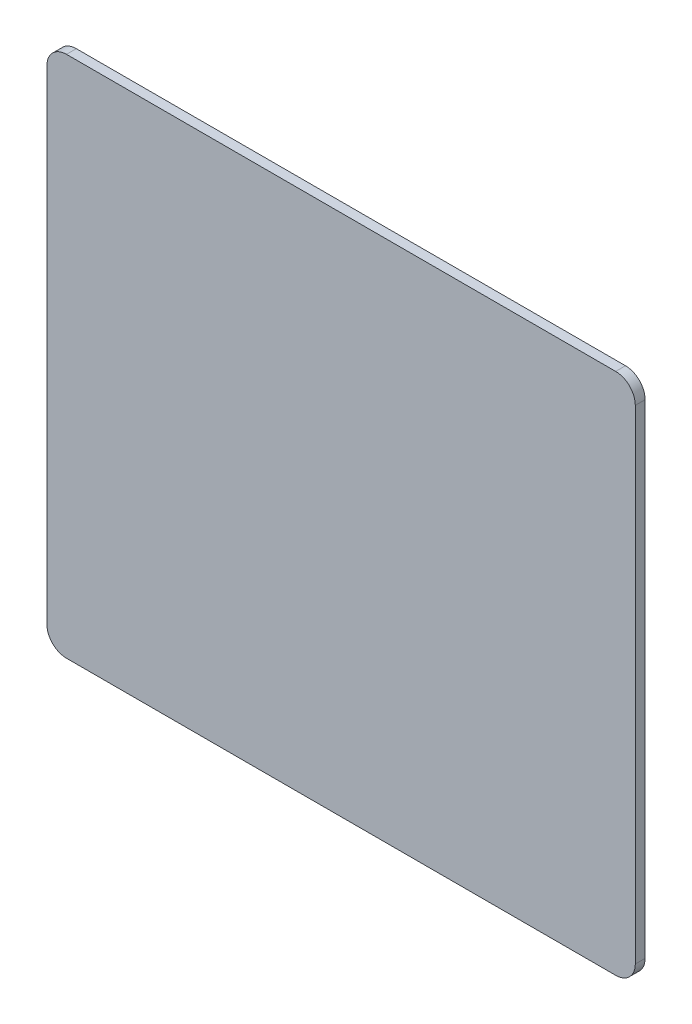
ISO-10303-21;
HEADER;
FILE_DESCRIPTION(('STEP AP214'),'2;1');
FILE_NAME('part.step','',(''),(''),'','','');
FILE_SCHEMA(('AUTOMOTIVE_DESIGN { 1 0 10303 214 1 1 1 1 }'));
ENDSEC;
DATA;
#1=APPLICATION_CONTEXT('core data for automotive mechanical design processes');
#2=APPLICATION_PROTOCOL_DEFINITION('international standard','automotive_design',2000,#1);
#3=PRODUCT_CONTEXT('',#1,'mechanical');
#4=PRODUCT('Part','Part','',(#3));
#5=PRODUCT_RELATED_PRODUCT_CATEGORY('part','',(#4));
#6=PRODUCT_DEFINITION_FORMATION('','',#4);
#7=PRODUCT_DEFINITION_CONTEXT('part definition',#1,'design');
#8=PRODUCT_DEFINITION('design','',#6,#7);
#9=PRODUCT_DEFINITION_SHAPE('','',#8);
#10=(LENGTH_UNIT() NAMED_UNIT(*) SI_UNIT(.MILLI.,.METRE.));
#11=(NAMED_UNIT(*) PLANE_ANGLE_UNIT() SI_UNIT($,.RADIAN.));
#12=(NAMED_UNIT(*) SI_UNIT($,.STERADIAN.) SOLID_ANGLE_UNIT());
#13=UNCERTAINTY_MEASURE_WITH_UNIT(LENGTH_MEASURE(1.E-05),#10,'distance_accuracy_value','');
#14=(GEOMETRIC_REPRESENTATION_CONTEXT(3) GLOBAL_UNCERTAINTY_ASSIGNED_CONTEXT((#13)) GLOBAL_UNIT_ASSIGNED_CONTEXT((#10,
#11,#12)) REPRESENTATION_CONTEXT('',''));
#15=CARTESIAN_POINT('',(0.,0.,0.));
#16=DIRECTION('',(0.,0.,1.));
#17=DIRECTION('',(1.,0.,0.));
#18=AXIS2_PLACEMENT_3D('',#15,#16,#17);
#19=CARTESIAN_POINT('',(42.,37.,1.5));
#20=DIRECTION('',(0.,0.,-1.));
#21=DIRECTION('',(-1.,0.,0.));
#22=AXIS2_PLACEMENT_3D('',#19,#20,#21);
#23=CYLINDRICAL_SURFACE('',#22,3.);
#24=CARTESIAN_POINT('',(42.,37.,0.));
#25=DIRECTION('',(0.,0.,1.));
#26=DIRECTION('',(-1.,0.,0.));
#27=AXIS2_PLACEMENT_3D('',#24,#25,#26);
#28=CIRCLE('',#27,3.);
#29=CARTESIAN_POINT('',(45.,37.,0.));
#30=VERTEX_POINT('',#29);
#31=CARTESIAN_POINT('',(42.,40.,0.));
#32=VERTEX_POINT('',#31);
#33=EDGE_CURVE('E129',#30,#32,#28,.T.);
#34=ORIENTED_EDGE('',*,*,#33,.T.);
#35=DIRECTION('',(0.,0.,-1.));
#36=VECTOR('',#35,1.);
#37=CARTESIAN_POINT('',(42.,40.,1.5));
#38=LINE('',#37,#36);
#39=CARTESIAN_POINT('',(42.,40.,1.5));
#40=VERTEX_POINT('',#39);
#41=EDGE_CURVE('E11',#40,#32,#38,.T.);
#42=ORIENTED_EDGE('',*,*,#41,.F.);
#43=CARTESIAN_POINT('',(42.,37.,1.5));
#44=DIRECTION('',(0.,0.,1.));
#45=DIRECTION('',(-1.,0.,0.));
#46=AXIS2_PLACEMENT_3D('',#43,#44,#45);
#47=CIRCLE('',#46,3.);
#48=CARTESIAN_POINT('',(45.,37.,1.5));
#49=VERTEX_POINT('',#48);
#50=EDGE_CURVE('E143',#49,#40,#47,.T.);
#51=ORIENTED_EDGE('',*,*,#50,.F.);
#52=DIRECTION('',(0.,0.,-1.));
#53=VECTOR('',#52,1.);
#54=CARTESIAN_POINT('',(45.,37.,1.5));
#55=LINE('',#54,#53);
#56=EDGE_CURVE('E125',#49,#30,#55,.T.);
#57=ORIENTED_EDGE('',*,*,#56,.T.);
#58=EDGE_LOOP('',(#34,#42,#51,#57));
#59=FACE_BOUND('',#58,.T.);
#60=ADVANCED_FACE('F33',(#59),#23,.T.);
#61=CARTESIAN_POINT('',(42.,40.,1.5));
#62=DIRECTION('',(0.,-1.,0.));
#63=DIRECTION('',(1.,0.,0.));
#64=AXIS2_PLACEMENT_3D('',#61,#62,#63);
#65=PLANE('',#64);
#66=DIRECTION('',(-1.,0.,0.));
#67=VECTOR('',#66,1.);
#68=CARTESIAN_POINT('',(42.,40.,0.));
#69=LINE('',#68,#67);
#70=CARTESIAN_POINT('',(-42.,40.,0.));
#71=VERTEX_POINT('',#70);
#72=EDGE_CURVE('E132',#32,#71,#69,.T.);
#73=ORIENTED_EDGE('',*,*,#72,.T.);
#74=DIRECTION('',(0.,0.,-1.));
#75=VECTOR('',#74,1.);
#76=CARTESIAN_POINT('',(-42.,40.,1.5));
#77=LINE('',#76,#75);
#78=CARTESIAN_POINT('',(-42.,40.,1.5));
#79=VERTEX_POINT('',#78);
#80=EDGE_CURVE('E41',#79,#71,#77,.T.);
#81=ORIENTED_EDGE('',*,*,#80,.F.);
#82=DIRECTION('',(-1.,0.,0.));
#83=VECTOR('',#82,1.);
#84=CARTESIAN_POINT('',(42.,40.,1.5));
#85=LINE('',#84,#83);
#86=EDGE_CURVE('E92',#40,#79,#85,.T.);
#87=ORIENTED_EDGE('',*,*,#86,.F.);
#88=ORIENTED_EDGE('',*,*,#41,.T.);
#89=EDGE_LOOP('',(#73,#81,#87,#88));
#90=FACE_BOUND('',#89,.T.);
#91=ADVANCED_FACE('F178',(#90),#65,.F.);
#92=CARTESIAN_POINT('',(-42.,37.,1.5));
#93=DIRECTION('',(0.,0.,-1.));
#94=DIRECTION('',(-1.,0.,0.));
#95=AXIS2_PLACEMENT_3D('',#92,#93,#94);
#96=CYLINDRICAL_SURFACE('',#95,3.);
#97=CARTESIAN_POINT('',(-42.,37.,0.));
#98=DIRECTION('',(0.,0.,1.));
#99=DIRECTION('',(-1.,0.,0.));
#100=AXIS2_PLACEMENT_3D('',#97,#98,#99);
#101=CIRCLE('',#100,3.);
#102=CARTESIAN_POINT('',(-45.,37.,0.));
#103=VERTEX_POINT('',#102);
#104=EDGE_CURVE('E134',#71,#103,#101,.T.);
#105=ORIENTED_EDGE('',*,*,#104,.T.);
#106=DIRECTION('',(0.,0.,-1.));
#107=VECTOR('',#106,1.);
#108=CARTESIAN_POINT('',(-45.,37.,1.5));
#109=LINE('',#108,#107);
#110=CARTESIAN_POINT('',(-45.,37.,1.5));
#111=VERTEX_POINT('',#110);
#112=EDGE_CURVE('E150',#111,#103,#109,.T.);
#113=ORIENTED_EDGE('',*,*,#112,.F.);
#114=CARTESIAN_POINT('',(-42.,37.,1.5));
#115=DIRECTION('',(0.,0.,1.));
#116=DIRECTION('',(-1.,0.,0.));
#117=AXIS2_PLACEMENT_3D('',#114,#115,#116);
#118=CIRCLE('',#117,3.);
#119=EDGE_CURVE('E158',#79,#111,#118,.T.);
#120=ORIENTED_EDGE('',*,*,#119,.F.);
#121=ORIENTED_EDGE('',*,*,#80,.T.);
#122=EDGE_LOOP('',(#105,#113,#120,#121));
#123=FACE_BOUND('',#122,.T.);
#124=ADVANCED_FACE('F156',(#123),#96,.T.);
#125=CARTESIAN_POINT('',(-45.,-37.,1.5));
#126=DIRECTION('',(1.,0.,0.));
#127=DIRECTION('',(0.,0.,-1.));
#128=AXIS2_PLACEMENT_3D('',#125,#126,#127);
#129=PLANE('',#128);
#130=DIRECTION('',(0.,-1.,0.));
#131=VECTOR('',#130,1.);
#132=CARTESIAN_POINT('',(-45.,-37.,0.));
#133=LINE('',#132,#131);
#134=CARTESIAN_POINT('',(-45.,-37.,0.));
#135=VERTEX_POINT('',#134);
#136=EDGE_CURVE('E136',#103,#135,#133,.T.);
#137=ORIENTED_EDGE('',*,*,#136,.T.);
#138=DIRECTION('',(0.,0.,-1.));
#139=VECTOR('',#138,1.);
#140=CARTESIAN_POINT('',(-45.,-37.,1.5));
#141=LINE('',#140,#139);
#142=CARTESIAN_POINT('',(-45.,-37.,1.5));
#143=VERTEX_POINT('',#142);
#144=EDGE_CURVE('E147',#143,#135,#141,.T.);
#145=ORIENTED_EDGE('',*,*,#144,.F.);
#146=DIRECTION('',(0.,-1.,0.));
#147=VECTOR('',#146,1.);
#148=CARTESIAN_POINT('',(-45.,-37.,1.5));
#149=LINE('',#148,#147);
#150=EDGE_CURVE('E170',#111,#143,#149,.T.);
#151=ORIENTED_EDGE('',*,*,#150,.F.);
#152=ORIENTED_EDGE('',*,*,#112,.T.);
#153=EDGE_LOOP('',(#137,#145,#151,#152));
#154=FACE_BOUND('',#153,.T.);
#155=ADVANCED_FACE('F166',(#154),#129,.F.);
#156=CARTESIAN_POINT('',(-42.,-37.,1.5));
#157=DIRECTION('',(0.,0.,-1.));
#158=DIRECTION('',(-1.,0.,0.));
#159=AXIS2_PLACEMENT_3D('',#156,#157,#158);
#160=CYLINDRICAL_SURFACE('',#159,3.);
#161=CARTESIAN_POINT('',(-42.,-37.,0.));
#162=DIRECTION('',(0.,0.,1.));
#163=DIRECTION('',(1.,0.,0.));
#164=AXIS2_PLACEMENT_3D('',#161,#162,#163);
#165=CIRCLE('',#164,3.);
#166=CARTESIAN_POINT('',(-42.,-40.,0.));
#167=VERTEX_POINT('',#166);
#168=EDGE_CURVE('E138',#135,#167,#165,.T.);
#169=ORIENTED_EDGE('',*,*,#168,.T.);
#170=DIRECTION('',(0.,0.,-1.));
#171=VECTOR('',#170,1.);
#172=CARTESIAN_POINT('',(-42.,-40.,1.5));
#173=LINE('',#172,#171);
#174=CARTESIAN_POINT('',(-42.,-40.,1.5));
#175=VERTEX_POINT('',#174);
#176=EDGE_CURVE('E120',#175,#167,#173,.T.);
#177=ORIENTED_EDGE('',*,*,#176,.F.);
#178=CARTESIAN_POINT('',(-42.,-37.,1.5));
#179=DIRECTION('',(0.,0.,1.));
#180=DIRECTION('',(1.,0.,0.));
#181=AXIS2_PLACEMENT_3D('',#178,#179,#180);
#182=CIRCLE('',#181,3.);
#183=EDGE_CURVE('E111',#143,#175,#182,.T.);
#184=ORIENTED_EDGE('',*,*,#183,.F.);
#185=ORIENTED_EDGE('',*,*,#144,.T.);
#186=EDGE_LOOP('',(#169,#177,#184,#185));
#187=FACE_BOUND('',#186,.T.);
#188=ADVANCED_FACE('F169',(#187),#160,.T.);
#189=CARTESIAN_POINT('',(42.,-40.,1.5));
#190=DIRECTION('',(0.,1.,0.));
#191=DIRECTION('',(-1.,0.,0.));
#192=AXIS2_PLACEMENT_3D('',#189,#190,#191);
#193=PLANE('',#192);
#194=DIRECTION('',(1.,0.,0.));
#195=VECTOR('',#194,1.);
#196=CARTESIAN_POINT('',(42.,-40.,0.));
#197=LINE('',#196,#195);
#198=CARTESIAN_POINT('',(42.,-40.,0.));
#199=VERTEX_POINT('',#198);
#200=EDGE_CURVE('E119',#167,#199,#197,.T.);
#201=ORIENTED_EDGE('',*,*,#200,.T.);
#202=DIRECTION('',(0.,0.,-1.));
#203=VECTOR('',#202,1.);
#204=CARTESIAN_POINT('',(42.,-40.,1.5));
#205=LINE('',#204,#203);
#206=CARTESIAN_POINT('',(42.,-40.,1.5));
#207=VERTEX_POINT('',#206);
#208=EDGE_CURVE('E116',#207,#199,#205,.T.);
#209=ORIENTED_EDGE('',*,*,#208,.F.);
#210=DIRECTION('',(1.,0.,0.));
#211=VECTOR('',#210,1.);
#212=CARTESIAN_POINT('',(42.,-40.,1.5));
#213=LINE('',#212,#211);
#214=EDGE_CURVE('E105',#175,#207,#213,.T.);
#215=ORIENTED_EDGE('',*,*,#214,.F.);
#216=ORIENTED_EDGE('',*,*,#176,.T.);
#217=EDGE_LOOP('',(#201,#209,#215,#216));
#218=FACE_BOUND('',#217,.T.);
#219=ADVANCED_FACE('F117',(#218),#193,.F.);
#220=CARTESIAN_POINT('',(42.,-37.,1.5));
#221=DIRECTION('',(0.,0.,-1.));
#222=DIRECTION('',(-1.,0.,0.));
#223=AXIS2_PLACEMENT_3D('',#220,#221,#222);
#224=CYLINDRICAL_SURFACE('',#223,3.);
#225=CARTESIAN_POINT('',(42.,-37.,0.));
#226=DIRECTION('',(0.,0.,1.));
#227=DIRECTION('',(-1.,0.,0.));
#228=AXIS2_PLACEMENT_3D('',#225,#226,#227);
#229=CIRCLE('',#228,3.);
#230=CARTESIAN_POINT('',(45.,-37.,0.));
#231=VERTEX_POINT('',#230);
#232=EDGE_CURVE('E78',#199,#231,#229,.T.);
#233=ORIENTED_EDGE('',*,*,#232,.T.);
#234=DIRECTION('',(0.,0.,-1.));
#235=VECTOR('',#234,1.);
#236=CARTESIAN_POINT('',(45.,-37.,1.5));
#237=LINE('',#236,#235);
#238=CARTESIAN_POINT('',(45.,-37.,1.5));
#239=VERTEX_POINT('',#238);
#240=EDGE_CURVE('E121',#239,#231,#237,.T.);
#241=ORIENTED_EDGE('',*,*,#240,.F.);
#242=CARTESIAN_POINT('',(42.,-37.,1.5));
#243=DIRECTION('',(0.,0.,1.));
#244=DIRECTION('',(-1.,0.,0.));
#245=AXIS2_PLACEMENT_3D('',#242,#243,#244);
#246=CIRCLE('',#245,3.);
#247=EDGE_CURVE('E109',#207,#239,#246,.T.);
#248=ORIENTED_EDGE('',*,*,#247,.F.);
#249=ORIENTED_EDGE('',*,*,#208,.T.);
#250=EDGE_LOOP('',(#233,#241,#248,#249));
#251=FACE_BOUND('',#250,.T.);
#252=ADVANCED_FACE('F123',(#251),#224,.T.);
#253=CARTESIAN_POINT('',(45.,-37.,1.5));
#254=DIRECTION('',(-1.,0.,0.));
#255=DIRECTION('',(0.,0.,1.));
#256=AXIS2_PLACEMENT_3D('',#253,#254,#255);
#257=PLANE('',#256);
#258=DIRECTION('',(0.,1.,0.));
#259=VECTOR('',#258,1.);
#260=CARTESIAN_POINT('',(45.,-37.,0.));
#261=LINE('',#260,#259);
#262=EDGE_CURVE('E84',#231,#30,#261,.T.);
#263=ORIENTED_EDGE('',*,*,#262,.T.);
#264=ORIENTED_EDGE('',*,*,#56,.F.);
#265=DIRECTION('',(0.,1.,0.));
#266=VECTOR('',#265,1.);
#267=CARTESIAN_POINT('',(45.,-37.,1.5));
#268=LINE('',#267,#266);
#269=EDGE_CURVE('E49',#239,#49,#268,.T.);
#270=ORIENTED_EDGE('',*,*,#269,.F.);
#271=ORIENTED_EDGE('',*,*,#240,.T.);
#272=EDGE_LOOP('',(#263,#264,#270,#271));
#273=FACE_BOUND('',#272,.T.);
#274=ADVANCED_FACE('F194',(#273),#257,.F.);
#275=CARTESIAN_POINT('',(42.,37.,1.5));
#276=DIRECTION('',(0.,0.,-1.));
#277=DIRECTION('',(-1.,0.,0.));
#278=AXIS2_PLACEMENT_3D('',#275,#276,#277);
#279=PLANE('',#278);
#280=ORIENTED_EDGE('',*,*,#50,.T.);
#281=ORIENTED_EDGE('',*,*,#86,.T.);
#282=ORIENTED_EDGE('',*,*,#119,.T.);
#283=ORIENTED_EDGE('',*,*,#150,.T.);
#284=ORIENTED_EDGE('',*,*,#183,.T.);
#285=ORIENTED_EDGE('',*,*,#214,.T.);
#286=ORIENTED_EDGE('',*,*,#247,.T.);
#287=ORIENTED_EDGE('',*,*,#269,.T.);
#288=EDGE_LOOP('',(#280,#281,#282,#283,#284,#285,#286,#287));
#289=FACE_BOUND('',#288,.T.);
#290=ADVANCED_FACE('F107',(#289),#279,.F.);
#291=CARTESIAN_POINT('',(42.,37.,0.));
#292=DIRECTION('',(0.,0.,-1.));
#293=DIRECTION('',(-1.,0.,0.));
#294=AXIS2_PLACEMENT_3D('',#291,#292,#293);
#295=PLANE('',#294);
#296=ORIENTED_EDGE('',*,*,#33,.F.);
#297=ORIENTED_EDGE('',*,*,#262,.F.);
#298=ORIENTED_EDGE('',*,*,#232,.F.);
#299=ORIENTED_EDGE('',*,*,#200,.F.);
#300=ORIENTED_EDGE('',*,*,#168,.F.);
#301=ORIENTED_EDGE('',*,*,#136,.F.);
#302=ORIENTED_EDGE('',*,*,#104,.F.);
#303=ORIENTED_EDGE('',*,*,#72,.F.);
#304=EDGE_LOOP('',(#296,#297,#298,#299,#300,#301,#302,#303));
#305=FACE_BOUND('',#304,.T.);
#306=ADVANCED_FACE('F162',(#305),#295,.T.);
#307=CLOSED_SHELL('',(#60,#91,#124,#155,#188,#219,#252,#274,#290,#306));
#308=MANIFOLD_SOLID_BREP('B2',#307);
#309=ADVANCED_BREP_SHAPE_REPRESENTATION('',(#18,#308),#14);
#310=SHAPE_DEFINITION_REPRESENTATION(#9,#309);
ENDSEC;
END-ISO-10303-21;
